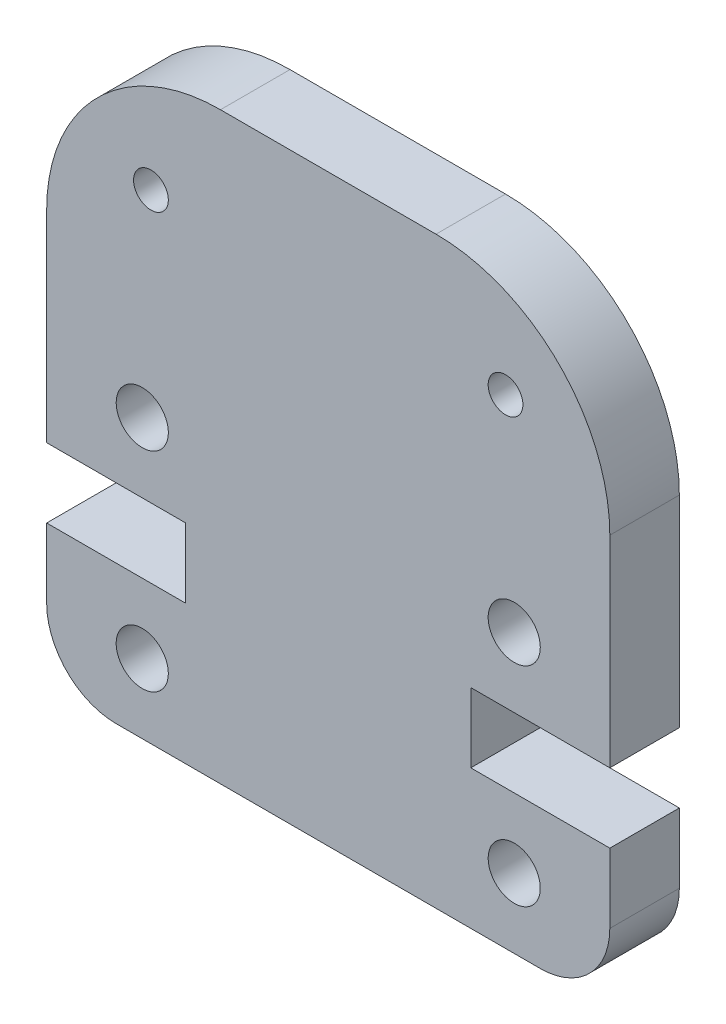
ISO-10303-21;
HEADER;
FILE_DESCRIPTION(('STEP AP214'),'2;1');
FILE_NAME('part.step','',(''),(''),'','','');
FILE_SCHEMA(('AUTOMOTIVE_DESIGN { 1 0 10303 214 1 1 1 1 }'));
ENDSEC;
DATA;
#1=APPLICATION_CONTEXT('core data for automotive mechanical design processes');
#2=APPLICATION_PROTOCOL_DEFINITION('international standard','automotive_design',2000,#1);
#3=PRODUCT_CONTEXT('',#1,'mechanical');
#4=PRODUCT('Part','Part','',(#3));
#5=PRODUCT_RELATED_PRODUCT_CATEGORY('part','',(#4));
#6=PRODUCT_DEFINITION_FORMATION('','',#4);
#7=PRODUCT_DEFINITION_CONTEXT('part definition',#1,'design');
#8=PRODUCT_DEFINITION('design','',#6,#7);
#9=PRODUCT_DEFINITION_SHAPE('','',#8);
#10=(LENGTH_UNIT() NAMED_UNIT(*) SI_UNIT(.MILLI.,.METRE.));
#11=(NAMED_UNIT(*) PLANE_ANGLE_UNIT() SI_UNIT($,.RADIAN.));
#12=(NAMED_UNIT(*) SI_UNIT($,.STERADIAN.) SOLID_ANGLE_UNIT());
#13=UNCERTAINTY_MEASURE_WITH_UNIT(LENGTH_MEASURE(1.E-05),#10,'distance_accuracy_value','');
#14=(GEOMETRIC_REPRESENTATION_CONTEXT(3) GLOBAL_UNCERTAINTY_ASSIGNED_CONTEXT((#13)) GLOBAL_UNIT_ASSIGNED_CONTEXT((#10,
#11,#12)) REPRESENTATION_CONTEXT('',''));
#15=CARTESIAN_POINT('',(0.,0.,0.));
#16=DIRECTION('',(0.,0.,1.));
#17=DIRECTION('',(1.,0.,0.));
#18=AXIS2_PLACEMENT_3D('',#15,#16,#17);
#19=CARTESIAN_POINT('',(5.,11.795,2.));
#20=DIRECTION('',(0.,0.,1.));
#21=DIRECTION('',(1.,0.,0.));
#22=AXIS2_PLACEMENT_3D('',#19,#20,#21);
#23=PLANE('',#22);
#24=CARTESIAN_POINT('',(2.75000000000089,2.,2.));
#25=DIRECTION('',(0.,0.,1.));
#26=DIRECTION('',(1.,0.,0.));
#27=AXIS2_PLACEMENT_3D('',#24,#25,#26);
#28=CIRCLE('',#27,0.750000000000087);
#29=CARTESIAN_POINT('',(3.50000000000098,2.,2.));
#30=VERTEX_POINT('',#29);
#31=EDGE_CURVE('E352',#30,#30,#28,.T.);
#32=ORIENTED_EDGE('',*,*,#31,.F.);
#33=EDGE_LOOP('',(#32));
#34=FACE_BOUND('',#33,.T.);
#35=CARTESIAN_POINT('',(3.00000000000434,13.7949999999999,2.));
#36=DIRECTION('',(0.,0.,1.));
#37=DIRECTION('',(1.,0.,0.));
#38=AXIS2_PLACEMENT_3D('',#35,#36,#37);
#39=CIRCLE('',#38,0.499999999999945);
#40=CARTESIAN_POINT('',(3.50000000000429,13.7949999999999,2.));
#41=VERTEX_POINT('',#40);
#42=EDGE_CURVE('E364',#41,#41,#39,.T.);
#43=ORIENTED_EDGE('',*,*,#42,.F.);
#44=EDGE_LOOP('',(#43));
#45=FACE_BOUND('',#44,.T.);
#46=CARTESIAN_POINT('',(13.4499999999991,2.,2.));
#47=DIRECTION('',(0.,0.,1.));
#48=DIRECTION('',(-1.,0.,0.));
#49=AXIS2_PLACEMENT_3D('',#46,#47,#48);
#50=CIRCLE('',#49,0.750000000000886);
#51=CARTESIAN_POINT('',(12.6999999999982,2.,2.));
#52=VERTEX_POINT('',#51);
#53=EDGE_CURVE('E182',#52,#52,#50,.T.);
#54=ORIENTED_EDGE('',*,*,#53,.F.);
#55=EDGE_LOOP('',(#54));
#56=FACE_BOUND('',#55,.T.);
#57=CARTESIAN_POINT('',(5.,11.795,2.));
#58=DIRECTION('',(0.,0.,1.));
#59=DIRECTION('',(1.,0.,0.));
#60=AXIS2_PLACEMENT_3D('',#57,#58,#59);
#61=CIRCLE('',#60,5.);
#62=CARTESIAN_POINT('',(5.,16.795,2.));
#63=VERTEX_POINT('',#62);
#64=CARTESIAN_POINT('',(0.,11.795,2.));
#65=VERTEX_POINT('',#64);
#66=EDGE_CURVE('E209',#63,#65,#61,.T.);
#67=ORIENTED_EDGE('',*,*,#66,.T.);
#68=DIRECTION('',(0.,-1.,0.));
#69=VECTOR('',#68,1.);
#70=CARTESIAN_POINT('',(0.,6.00000000000001,2.));
#71=LINE('',#70,#69);
#72=CARTESIAN_POINT('',(0.,6.00000000000001,2.));
#73=VERTEX_POINT('',#72);
#74=EDGE_CURVE('E117',#65,#73,#71,.T.);
#75=ORIENTED_EDGE('',*,*,#74,.T.);
#76=DIRECTION('',(1.,0.,0.));
#77=VECTOR('',#76,1.);
#78=CARTESIAN_POINT('',(0.,6.00000000000001,2.));
#79=LINE('',#78,#77);
#80=CARTESIAN_POINT('',(4.,6.00000000000001,2.));
#81=VERTEX_POINT('',#80);
#82=EDGE_CURVE('E248',#73,#81,#79,.T.);
#83=ORIENTED_EDGE('',*,*,#82,.T.);
#84=DIRECTION('',(0.,-1.,0.));
#85=VECTOR('',#84,1.);
#86=CARTESIAN_POINT('',(4.,6.00000000000001,2.));
#87=LINE('',#86,#85);
#88=CARTESIAN_POINT('',(4.,4.,2.));
#89=VERTEX_POINT('',#88);
#90=EDGE_CURVE('E267',#81,#89,#87,.T.);
#91=ORIENTED_EDGE('',*,*,#90,.T.);
#92=DIRECTION('',(-1.,0.,0.));
#93=VECTOR('',#92,1.);
#94=CARTESIAN_POINT('',(4.,4.,2.));
#95=LINE('',#94,#93);
#96=CARTESIAN_POINT('',(0.,4.,2.));
#97=VERTEX_POINT('',#96);
#98=EDGE_CURVE('E264',#89,#97,#95,.T.);
#99=ORIENTED_EDGE('',*,*,#98,.T.);
#100=DIRECTION('',(0.,-1.,0.));
#101=VECTOR('',#100,1.);
#102=CARTESIAN_POINT('',(0.,2.,2.));
#103=LINE('',#102,#101);
#104=CARTESIAN_POINT('',(0.,2.,2.));
#105=VERTEX_POINT('',#104);
#106=EDGE_CURVE('E266',#97,#105,#103,.T.);
#107=ORIENTED_EDGE('',*,*,#106,.T.);
#108=CARTESIAN_POINT('',(2.,2.,2.));
#109=DIRECTION('',(0.,0.,1.));
#110=DIRECTION('',(1.,0.,0.));
#111=AXIS2_PLACEMENT_3D('',#108,#109,#110);
#112=CIRCLE('',#111,2.);
#113=CARTESIAN_POINT('',(2.,0.,2.));
#114=VERTEX_POINT('',#113);
#115=EDGE_CURVE('E269',#105,#114,#112,.T.);
#116=ORIENTED_EDGE('',*,*,#115,.T.);
#117=DIRECTION('',(1.,0.,0.));
#118=VECTOR('',#117,1.);
#119=CARTESIAN_POINT('',(2.,0.,2.));
#120=LINE('',#119,#118);
#121=CARTESIAN_POINT('',(14.2,0.,2.));
#122=VERTEX_POINT('',#121);
#123=EDGE_CURVE('E275',#114,#122,#120,.T.);
#124=ORIENTED_EDGE('',*,*,#123,.T.);
#125=CARTESIAN_POINT('',(14.2,2.,2.));
#126=DIRECTION('',(0.,0.,1.));
#127=DIRECTION('',(-1.,0.,0.));
#128=AXIS2_PLACEMENT_3D('',#125,#126,#127);
#129=CIRCLE('',#128,2.);
#130=CARTESIAN_POINT('',(16.2,2.,2.));
#131=VERTEX_POINT('',#130);
#132=EDGE_CURVE('E277',#122,#131,#129,.T.);
#133=ORIENTED_EDGE('',*,*,#132,.T.);
#134=DIRECTION('',(0.,1.,0.));
#135=VECTOR('',#134,1.);
#136=CARTESIAN_POINT('',(16.2,2.,2.));
#137=LINE('',#136,#135);
#138=CARTESIAN_POINT('',(16.2,4.,2.));
#139=VERTEX_POINT('',#138);
#140=EDGE_CURVE('E279',#131,#139,#137,.T.);
#141=ORIENTED_EDGE('',*,*,#140,.T.);
#142=DIRECTION('',(-1.,0.,0.));
#143=VECTOR('',#142,1.);
#144=CARTESIAN_POINT('',(12.2,4.,2.));
#145=LINE('',#144,#143);
#146=CARTESIAN_POINT('',(12.2,4.,2.));
#147=VERTEX_POINT('',#146);
#148=EDGE_CURVE('E281',#139,#147,#145,.T.);
#149=ORIENTED_EDGE('',*,*,#148,.T.);
#150=DIRECTION('',(0.,1.,0.));
#151=VECTOR('',#150,1.);
#152=CARTESIAN_POINT('',(12.2,6.,2.));
#153=LINE('',#152,#151);
#154=CARTESIAN_POINT('',(12.2,6.,2.));
#155=VERTEX_POINT('',#154);
#156=EDGE_CURVE('E283',#147,#155,#153,.T.);
#157=ORIENTED_EDGE('',*,*,#156,.T.);
#158=DIRECTION('',(1.,0.,0.));
#159=VECTOR('',#158,1.);
#160=CARTESIAN_POINT('',(16.2,6.00000000000001,2.));
#161=LINE('',#160,#159);
#162=CARTESIAN_POINT('',(16.2,6.00000000000001,2.));
#163=VERTEX_POINT('',#162);
#164=EDGE_CURVE('E160',#155,#163,#161,.T.);
#165=ORIENTED_EDGE('',*,*,#164,.T.);
#166=DIRECTION('',(0.,1.,0.));
#167=VECTOR('',#166,1.);
#168=CARTESIAN_POINT('',(16.2,6.00000000000001,2.));
#169=LINE('',#168,#167);
#170=CARTESIAN_POINT('',(16.2,11.795,2.));
#171=VERTEX_POINT('',#170);
#172=EDGE_CURVE('E154',#163,#171,#169,.T.);
#173=ORIENTED_EDGE('',*,*,#172,.T.);
#174=CARTESIAN_POINT('',(11.2,11.795,2.));
#175=DIRECTION('',(0.,0.,1.));
#176=DIRECTION('',(-1.,0.,0.));
#177=AXIS2_PLACEMENT_3D('',#174,#175,#176);
#178=CIRCLE('',#177,5.);
#179=CARTESIAN_POINT('',(11.2,16.795,2.));
#180=VERTEX_POINT('',#179);
#181=EDGE_CURVE('E158',#171,#180,#178,.T.);
#182=ORIENTED_EDGE('',*,*,#181,.T.);
#183=DIRECTION('',(-1.,0.,0.));
#184=VECTOR('',#183,1.);
#185=CARTESIAN_POINT('',(5.,16.795,2.));
#186=LINE('',#185,#184);
#187=EDGE_CURVE('E50',#180,#63,#186,.T.);
#188=ORIENTED_EDGE('',*,*,#187,.T.);
#189=EDGE_LOOP('',(#67,#75,#83,#91,#99,#107,#116,#124,#133,#141,#149,#157,#165,#173,#182,#188));
#190=FACE_BOUND('',#189,.T.);
#191=CARTESIAN_POINT('',(13.4499999999991,7.99999999999954,2.));
#192=DIRECTION('',(0.,0.,1.));
#193=DIRECTION('',(1.,0.,0.));
#194=AXIS2_PLACEMENT_3D('',#191,#192,#193);
#195=CIRCLE('',#194,0.750000000000887);
#196=CARTESIAN_POINT('',(14.2,7.99999999999954,2.));
#197=VERTEX_POINT('',#196);
#198=EDGE_CURVE('E370',#197,#197,#195,.T.);
#199=ORIENTED_EDGE('',*,*,#198,.F.);
#200=EDGE_LOOP('',(#199));
#201=FACE_BOUND('',#200,.T.);
#202=CARTESIAN_POINT('',(13.1999999999957,13.7949999999999,2.));
#203=DIRECTION('',(0.,0.,1.));
#204=DIRECTION('',(-1.,0.,0.));
#205=AXIS2_PLACEMENT_3D('',#202,#203,#204);
#206=CIRCLE('',#205,0.499999999999945);
#207=CARTESIAN_POINT('',(12.6999999999957,13.7949999999999,2.));
#208=VERTEX_POINT('',#207);
#209=EDGE_CURVE('E358',#208,#208,#206,.T.);
#210=ORIENTED_EDGE('',*,*,#209,.F.);
#211=EDGE_LOOP('',(#210));
#212=FACE_BOUND('',#211,.T.);
#213=CARTESIAN_POINT('',(2.75000000000089,7.99999999999954,2.));
#214=DIRECTION('',(0.,0.,1.));
#215=DIRECTION('',(-1.,0.,0.));
#216=AXIS2_PLACEMENT_3D('',#213,#214,#215);
#217=CIRCLE('',#216,0.750000000000087);
#218=CARTESIAN_POINT('',(2.0000000000008,7.99999999999954,2.));
#219=VERTEX_POINT('',#218);
#220=EDGE_CURVE('E343',#219,#219,#217,.T.);
#221=ORIENTED_EDGE('',*,*,#220,.F.);
#222=EDGE_LOOP('',(#221));
#223=FACE_BOUND('',#222,.T.);
#224=ADVANCED_FACE('F33',(#34,#45,#56,#190,#201,#212,#223),#23,.T.);
#225=CARTESIAN_POINT('',(5.,11.795,0.));
#226=DIRECTION('',(0.,0.,1.));
#227=DIRECTION('',(1.,0.,0.));
#228=AXIS2_PLACEMENT_3D('',#225,#226,#227);
#229=PLANE('',#228);
#230=CARTESIAN_POINT('',(2.75000000000089,2.,0.));
#231=DIRECTION('',(0.,0.,1.));
#232=DIRECTION('',(1.,0.,0.));
#233=AXIS2_PLACEMENT_3D('',#230,#231,#232);
#234=CIRCLE('',#233,0.750000000000087);
#235=CARTESIAN_POINT('',(3.50000000000098,2.,0.));
#236=VERTEX_POINT('',#235);
#237=EDGE_CURVE('E349',#236,#236,#234,.T.);
#238=ORIENTED_EDGE('',*,*,#237,.T.);
#239=EDGE_LOOP('',(#238));
#240=FACE_BOUND('',#239,.T.);
#241=CARTESIAN_POINT('',(3.00000000000434,13.7949999999999,0.));
#242=DIRECTION('',(0.,0.,1.));
#243=DIRECTION('',(1.,0.,0.));
#244=AXIS2_PLACEMENT_3D('',#241,#242,#243);
#245=CIRCLE('',#244,0.499999999999945);
#246=CARTESIAN_POINT('',(3.50000000000429,13.7949999999999,0.));
#247=VERTEX_POINT('',#246);
#248=EDGE_CURVE('E361',#247,#247,#245,.T.);
#249=ORIENTED_EDGE('',*,*,#248,.T.);
#250=EDGE_LOOP('',(#249));
#251=FACE_BOUND('',#250,.T.);
#252=CARTESIAN_POINT('',(13.4499999999991,2.,0.));
#253=DIRECTION('',(0.,0.,1.));
#254=DIRECTION('',(-1.,0.,0.));
#255=AXIS2_PLACEMENT_3D('',#252,#253,#254);
#256=CIRCLE('',#255,0.750000000000886);
#257=CARTESIAN_POINT('',(12.6999999999982,2.,0.));
#258=VERTEX_POINT('',#257);
#259=EDGE_CURVE('E373',#258,#258,#256,.T.);
#260=ORIENTED_EDGE('',*,*,#259,.T.);
#261=EDGE_LOOP('',(#260));
#262=FACE_BOUND('',#261,.T.);
#263=CARTESIAN_POINT('',(5.,11.795,0.));
#264=DIRECTION('',(0.,0.,1.));
#265=DIRECTION('',(1.,0.,0.));
#266=AXIS2_PLACEMENT_3D('',#263,#264,#265);
#267=CIRCLE('',#266,5.);
#268=CARTESIAN_POINT('',(5.,16.795,0.));
#269=VERTEX_POINT('',#268);
#270=CARTESIAN_POINT('',(0.,11.795,0.));
#271=VERTEX_POINT('',#270);
#272=EDGE_CURVE('E178',#269,#271,#267,.T.);
#273=ORIENTED_EDGE('',*,*,#272,.F.);
#274=DIRECTION('',(-1.,0.,0.));
#275=VECTOR('',#274,1.);
#276=CARTESIAN_POINT('',(5.,16.795,0.));
#277=LINE('',#276,#275);
#278=CARTESIAN_POINT('',(11.2,16.795,0.));
#279=VERTEX_POINT('',#278);
#280=EDGE_CURVE('E109',#279,#269,#277,.T.);
#281=ORIENTED_EDGE('',*,*,#280,.F.);
#282=CARTESIAN_POINT('',(11.2,11.795,0.));
#283=DIRECTION('',(0.,0.,1.));
#284=DIRECTION('',(-1.,0.,0.));
#285=AXIS2_PLACEMENT_3D('',#282,#283,#284);
#286=CIRCLE('',#285,5.);
#287=CARTESIAN_POINT('',(16.2,11.795,0.));
#288=VERTEX_POINT('',#287);
#289=EDGE_CURVE('E103',#288,#279,#286,.T.);
#290=ORIENTED_EDGE('',*,*,#289,.F.);
#291=DIRECTION('',(0.,1.,0.));
#292=VECTOR('',#291,1.);
#293=CARTESIAN_POINT('',(16.2,6.00000000000001,0.));
#294=LINE('',#293,#292);
#295=CARTESIAN_POINT('',(16.2,6.00000000000001,0.));
#296=VERTEX_POINT('',#295);
#297=EDGE_CURVE('E168',#296,#288,#294,.T.);
#298=ORIENTED_EDGE('',*,*,#297,.F.);
#299=DIRECTION('',(1.,0.,0.));
#300=VECTOR('',#299,1.);
#301=CARTESIAN_POINT('',(16.2,6.00000000000001,0.));
#302=LINE('',#301,#300);
#303=CARTESIAN_POINT('',(12.2,6.,0.));
#304=VERTEX_POINT('',#303);
#305=EDGE_CURVE('E204',#304,#296,#302,.T.);
#306=ORIENTED_EDGE('',*,*,#305,.F.);
#307=DIRECTION('',(0.,1.,0.));
#308=VECTOR('',#307,1.);
#309=CARTESIAN_POINT('',(12.2,6.,0.));
#310=LINE('',#309,#308);
#311=CARTESIAN_POINT('',(12.2,4.,0.));
#312=VERTEX_POINT('',#311);
#313=EDGE_CURVE('E202',#312,#304,#310,.T.);
#314=ORIENTED_EDGE('',*,*,#313,.F.);
#315=DIRECTION('',(-1.,0.,0.));
#316=VECTOR('',#315,1.);
#317=CARTESIAN_POINT('',(12.2,4.,0.));
#318=LINE('',#317,#316);
#319=CARTESIAN_POINT('',(16.2,4.,0.));
#320=VERTEX_POINT('',#319);
#321=EDGE_CURVE('E200',#320,#312,#318,.T.);
#322=ORIENTED_EDGE('',*,*,#321,.F.);
#323=DIRECTION('',(0.,1.,0.));
#324=VECTOR('',#323,1.);
#325=CARTESIAN_POINT('',(16.2,2.,0.));
#326=LINE('',#325,#324);
#327=CARTESIAN_POINT('',(16.2,2.,0.));
#328=VERTEX_POINT('',#327);
#329=EDGE_CURVE('E198',#328,#320,#326,.T.);
#330=ORIENTED_EDGE('',*,*,#329,.F.);
#331=CARTESIAN_POINT('',(14.2,2.,0.));
#332=DIRECTION('',(0.,0.,1.));
#333=DIRECTION('',(-1.,0.,0.));
#334=AXIS2_PLACEMENT_3D('',#331,#332,#333);
#335=CIRCLE('',#334,2.);
#336=CARTESIAN_POINT('',(14.2,0.,0.));
#337=VERTEX_POINT('',#336);
#338=EDGE_CURVE('E196',#337,#328,#335,.T.);
#339=ORIENTED_EDGE('',*,*,#338,.F.);
#340=DIRECTION('',(1.,0.,0.));
#341=VECTOR('',#340,1.);
#342=CARTESIAN_POINT('',(2.,0.,0.));
#343=LINE('',#342,#341);
#344=CARTESIAN_POINT('',(2.,0.,0.));
#345=VERTEX_POINT('',#344);
#346=EDGE_CURVE('E194',#345,#337,#343,.T.);
#347=ORIENTED_EDGE('',*,*,#346,.F.);
#348=CARTESIAN_POINT('',(2.,2.,0.));
#349=DIRECTION('',(0.,0.,1.));
#350=DIRECTION('',(1.,0.,0.));
#351=AXIS2_PLACEMENT_3D('',#348,#349,#350);
#352=CIRCLE('',#351,2.);
#353=CARTESIAN_POINT('',(0.,2.,0.));
#354=VERTEX_POINT('',#353);
#355=EDGE_CURVE('E192',#354,#345,#352,.T.);
#356=ORIENTED_EDGE('',*,*,#355,.F.);
#357=DIRECTION('',(0.,-1.,0.));
#358=VECTOR('',#357,1.);
#359=CARTESIAN_POINT('',(0.,2.,0.));
#360=LINE('',#359,#358);
#361=CARTESIAN_POINT('',(0.,4.,0.));
#362=VERTEX_POINT('',#361);
#363=EDGE_CURVE('E190',#362,#354,#360,.T.);
#364=ORIENTED_EDGE('',*,*,#363,.F.);
#365=DIRECTION('',(-1.,0.,0.));
#366=VECTOR('',#365,1.);
#367=CARTESIAN_POINT('',(4.,4.,0.));
#368=LINE('',#367,#366);
#369=CARTESIAN_POINT('',(4.,4.,0.));
#370=VERTEX_POINT('',#369);
#371=EDGE_CURVE('E188',#370,#362,#368,.T.);
#372=ORIENTED_EDGE('',*,*,#371,.F.);
#373=DIRECTION('',(0.,-1.,0.));
#374=VECTOR('',#373,1.);
#375=CARTESIAN_POINT('',(4.,6.00000000000001,0.));
#376=LINE('',#375,#374);
#377=CARTESIAN_POINT('',(4.,6.00000000000001,0.));
#378=VERTEX_POINT('',#377);
#379=EDGE_CURVE('E186',#378,#370,#376,.T.);
#380=ORIENTED_EDGE('',*,*,#379,.F.);
#381=DIRECTION('',(1.,0.,0.));
#382=VECTOR('',#381,1.);
#383=CARTESIAN_POINT('',(0.,6.00000000000001,0.));
#384=LINE('',#383,#382);
#385=CARTESIAN_POINT('',(0.,6.00000000000001,0.));
#386=VERTEX_POINT('',#385);
#387=EDGE_CURVE('E184',#386,#378,#384,.T.);
#388=ORIENTED_EDGE('',*,*,#387,.F.);
#389=DIRECTION('',(0.,-1.,0.));
#390=VECTOR('',#389,1.);
#391=CARTESIAN_POINT('',(0.,6.00000000000001,0.));
#392=LINE('',#391,#390);
#393=EDGE_CURVE('E181',#271,#386,#392,.T.);
#394=ORIENTED_EDGE('',*,*,#393,.F.);
#395=EDGE_LOOP('',(#273,#281,#290,#298,#306,#314,#322,#330,#339,#347,#356,#364,#372,#380,#388,#394));
#396=FACE_BOUND('',#395,.T.);
#397=CARTESIAN_POINT('',(13.4499999999991,7.99999999999954,0.));
#398=DIRECTION('',(0.,0.,1.));
#399=DIRECTION('',(1.,0.,0.));
#400=AXIS2_PLACEMENT_3D('',#397,#398,#399);
#401=CIRCLE('',#400,0.750000000000887);
#402=CARTESIAN_POINT('',(14.2,7.99999999999954,0.));
#403=VERTEX_POINT('',#402);
#404=EDGE_CURVE('E367',#403,#403,#401,.T.);
#405=ORIENTED_EDGE('',*,*,#404,.T.);
#406=EDGE_LOOP('',(#405));
#407=FACE_BOUND('',#406,.T.);
#408=CARTESIAN_POINT('',(13.1999999999957,13.7949999999999,0.));
#409=DIRECTION('',(0.,0.,1.));
#410=DIRECTION('',(-1.,0.,0.));
#411=AXIS2_PLACEMENT_3D('',#408,#409,#410);
#412=CIRCLE('',#411,0.499999999999945);
#413=CARTESIAN_POINT('',(12.6999999999957,13.7949999999999,0.));
#414=VERTEX_POINT('',#413);
#415=EDGE_CURVE('E355',#414,#414,#412,.T.);
#416=ORIENTED_EDGE('',*,*,#415,.T.);
#417=EDGE_LOOP('',(#416));
#418=FACE_BOUND('',#417,.T.);
#419=CARTESIAN_POINT('',(2.75000000000089,7.99999999999954,0.));
#420=DIRECTION('',(0.,0.,1.));
#421=DIRECTION('',(-1.,0.,0.));
#422=AXIS2_PLACEMENT_3D('',#419,#420,#421);
#423=CIRCLE('',#422,0.750000000000087);
#424=CARTESIAN_POINT('',(2.0000000000008,7.99999999999954,0.));
#425=VERTEX_POINT('',#424);
#426=EDGE_CURVE('E346',#425,#425,#423,.T.);
#427=ORIENTED_EDGE('',*,*,#426,.T.);
#428=EDGE_LOOP('',(#427));
#429=FACE_BOUND('',#428,.T.);
#430=ADVANCED_FACE('F252',(#240,#251,#262,#396,#407,#418,#429),#229,.F.);
#431=CARTESIAN_POINT('',(5.,11.795,2.));
#432=DIRECTION('',(0.,0.,-1.));
#433=DIRECTION('',(-1.,0.,0.));
#434=AXIS2_PLACEMENT_3D('',#431,#432,#433);
#435=CYLINDRICAL_SURFACE('',#434,5.);
#436=ORIENTED_EDGE('',*,*,#272,.T.);
#437=DIRECTION('',(0.,0.,-1.));
#438=VECTOR('',#437,1.);
#439=CARTESIAN_POINT('',(0.,11.795,2.));
#440=LINE('',#439,#438);
#441=EDGE_CURVE('E11',#65,#271,#440,.T.);
#442=ORIENTED_EDGE('',*,*,#441,.F.);
#443=ORIENTED_EDGE('',*,*,#66,.F.);
#444=DIRECTION('',(0.,0.,-1.));
#445=VECTOR('',#444,1.);
#446=CARTESIAN_POINT('',(5.,16.795,2.));
#447=LINE('',#446,#445);
#448=EDGE_CURVE('E174',#63,#269,#447,.T.);
#449=ORIENTED_EDGE('',*,*,#448,.T.);
#450=EDGE_LOOP('',(#436,#442,#443,#449));
#451=FACE_BOUND('',#450,.T.);
#452=ADVANCED_FACE('F35',(#451),#435,.T.);
#453=CARTESIAN_POINT('',(0.,6.00000000000001,2.));
#454=DIRECTION('',(1.,0.,0.));
#455=DIRECTION('',(0.,0.,-1.));
#456=AXIS2_PLACEMENT_3D('',#453,#454,#455);
#457=PLANE('',#456);
#458=ORIENTED_EDGE('',*,*,#393,.T.);
#459=DIRECTION('',(0.,0.,-1.));
#460=VECTOR('',#459,1.);
#461=CARTESIAN_POINT('',(0.,6.00000000000001,2.));
#462=LINE('',#461,#460);
#463=EDGE_CURVE('E42',#73,#386,#462,.T.);
#464=ORIENTED_EDGE('',*,*,#463,.F.);
#465=ORIENTED_EDGE('',*,*,#74,.F.);
#466=ORIENTED_EDGE('',*,*,#441,.T.);
#467=EDGE_LOOP('',(#458,#464,#465,#466));
#468=FACE_BOUND('',#467,.T.);
#469=ADVANCED_FACE('F540',(#468),#457,.F.);
#470=CARTESIAN_POINT('',(0.,6.00000000000001,2.));
#471=DIRECTION('',(0.,1.,0.));
#472=DIRECTION('',(0.,0.,1.));
#473=AXIS2_PLACEMENT_3D('',#470,#471,#472);
#474=PLANE('',#473);
#475=ORIENTED_EDGE('',*,*,#387,.T.);
#476=DIRECTION('',(0.,0.,-1.));
#477=VECTOR('',#476,1.);
#478=CARTESIAN_POINT('',(4.,6.00000000000001,2.));
#479=LINE('',#478,#477);
#480=EDGE_CURVE('E240',#81,#378,#479,.T.);
#481=ORIENTED_EDGE('',*,*,#480,.F.);
#482=ORIENTED_EDGE('',*,*,#82,.F.);
#483=ORIENTED_EDGE('',*,*,#463,.T.);
#484=EDGE_LOOP('',(#475,#481,#482,#483));
#485=FACE_BOUND('',#484,.T.);
#486=ADVANCED_FACE('F246',(#485),#474,.F.);
#487=CARTESIAN_POINT('',(4.,6.00000000000001,2.));
#488=DIRECTION('',(1.,0.,0.));
#489=DIRECTION('',(0.,0.,-1.));
#490=AXIS2_PLACEMENT_3D('',#487,#488,#489);
#491=PLANE('',#490);
#492=ORIENTED_EDGE('',*,*,#379,.T.);
#493=DIRECTION('',(0.,0.,-1.));
#494=VECTOR('',#493,1.);
#495=CARTESIAN_POINT('',(4.,4.,2.));
#496=LINE('',#495,#494);
#497=EDGE_CURVE('E237',#89,#370,#496,.T.);
#498=ORIENTED_EDGE('',*,*,#497,.F.);
#499=ORIENTED_EDGE('',*,*,#90,.F.);
#500=ORIENTED_EDGE('',*,*,#480,.T.);
#501=EDGE_LOOP('',(#492,#498,#499,#500));
#502=FACE_BOUND('',#501,.T.);
#503=ADVANCED_FACE('F258',(#502),#491,.F.);
#504=CARTESIAN_POINT('',(4.,4.,2.));
#505=DIRECTION('',(0.,-1.,0.));
#506=DIRECTION('',(0.,0.,-1.));
#507=AXIS2_PLACEMENT_3D('',#504,#505,#506);
#508=PLANE('',#507);
#509=ORIENTED_EDGE('',*,*,#371,.T.);
#510=DIRECTION('',(0.,0.,-1.));
#511=VECTOR('',#510,1.);
#512=CARTESIAN_POINT('',(0.,4.,2.));
#513=LINE('',#512,#511);
#514=EDGE_CURVE('E234',#97,#362,#513,.T.);
#515=ORIENTED_EDGE('',*,*,#514,.F.);
#516=ORIENTED_EDGE('',*,*,#98,.F.);
#517=ORIENTED_EDGE('',*,*,#497,.T.);
#518=EDGE_LOOP('',(#509,#515,#516,#517));
#519=FACE_BOUND('',#518,.T.);
#520=ADVANCED_FACE('F262',(#519),#508,.F.);
#521=CARTESIAN_POINT('',(0.,2.,2.));
#522=DIRECTION('',(1.,0.,0.));
#523=DIRECTION('',(0.,0.,-1.));
#524=AXIS2_PLACEMENT_3D('',#521,#522,#523);
#525=PLANE('',#524);
#526=ORIENTED_EDGE('',*,*,#363,.T.);
#527=DIRECTION('',(0.,0.,-1.));
#528=VECTOR('',#527,1.);
#529=CARTESIAN_POINT('',(0.,2.,2.));
#530=LINE('',#529,#528);
#531=EDGE_CURVE('E231',#105,#354,#530,.T.);
#532=ORIENTED_EDGE('',*,*,#531,.F.);
#533=ORIENTED_EDGE('',*,*,#106,.F.);
#534=ORIENTED_EDGE('',*,*,#514,.T.);
#535=EDGE_LOOP('',(#526,#532,#533,#534));
#536=FACE_BOUND('',#535,.T.);
#537=ADVANCED_FACE('F505',(#536),#525,.F.);
#538=CARTESIAN_POINT('',(2.,2.,2.));
#539=DIRECTION('',(0.,0.,-1.));
#540=DIRECTION('',(-1.,0.,0.));
#541=AXIS2_PLACEMENT_3D('',#538,#539,#540);
#542=CYLINDRICAL_SURFACE('',#541,2.);
#543=ORIENTED_EDGE('',*,*,#355,.T.);
#544=DIRECTION('',(0.,0.,-1.));
#545=VECTOR('',#544,1.);
#546=CARTESIAN_POINT('',(2.,0.,2.));
#547=LINE('',#546,#545);
#548=EDGE_CURVE('E228',#114,#345,#547,.T.);
#549=ORIENTED_EDGE('',*,*,#548,.F.);
#550=ORIENTED_EDGE('',*,*,#115,.F.);
#551=ORIENTED_EDGE('',*,*,#531,.T.);
#552=EDGE_LOOP('',(#543,#549,#550,#551));
#553=FACE_BOUND('',#552,.T.);
#554=ADVANCED_FACE('F495',(#553),#542,.T.);
#555=CARTESIAN_POINT('',(2.,0.,2.));
#556=DIRECTION('',(0.,1.,0.));
#557=DIRECTION('',(-1.,0.,0.));
#558=AXIS2_PLACEMENT_3D('',#555,#556,#557);
#559=PLANE('',#558);
#560=ORIENTED_EDGE('',*,*,#346,.T.);
#561=DIRECTION('',(0.,0.,-1.));
#562=VECTOR('',#561,1.);
#563=CARTESIAN_POINT('',(14.2,0.,2.));
#564=LINE('',#563,#562);
#565=EDGE_CURVE('E225',#122,#337,#564,.T.);
#566=ORIENTED_EDGE('',*,*,#565,.F.);
#567=ORIENTED_EDGE('',*,*,#123,.F.);
#568=ORIENTED_EDGE('',*,*,#548,.T.);
#569=EDGE_LOOP('',(#560,#566,#567,#568));
#570=FACE_BOUND('',#569,.T.);
#571=ADVANCED_FACE('F485',(#570),#559,.F.);
#572=CARTESIAN_POINT('',(14.2,2.,2.));
#573=DIRECTION('',(0.,0.,-1.));
#574=DIRECTION('',(-1.,0.,0.));
#575=AXIS2_PLACEMENT_3D('',#572,#573,#574);
#576=CYLINDRICAL_SURFACE('',#575,2.);
#577=ORIENTED_EDGE('',*,*,#338,.T.);
#578=DIRECTION('',(0.,0.,-1.));
#579=VECTOR('',#578,1.);
#580=CARTESIAN_POINT('',(16.2,2.,2.));
#581=LINE('',#580,#579);
#582=EDGE_CURVE('E222',#131,#328,#581,.T.);
#583=ORIENTED_EDGE('',*,*,#582,.F.);
#584=ORIENTED_EDGE('',*,*,#132,.F.);
#585=ORIENTED_EDGE('',*,*,#565,.T.);
#586=EDGE_LOOP('',(#577,#583,#584,#585));
#587=FACE_BOUND('',#586,.T.);
#588=ADVANCED_FACE('F475',(#587),#576,.T.);
#589=CARTESIAN_POINT('',(16.2,2.,2.));
#590=DIRECTION('',(-1.,0.,0.));
#591=DIRECTION('',(0.,0.,1.));
#592=AXIS2_PLACEMENT_3D('',#589,#590,#591);
#593=PLANE('',#592);
#594=ORIENTED_EDGE('',*,*,#329,.T.);
#595=DIRECTION('',(0.,0.,-1.));
#596=VECTOR('',#595,1.);
#597=CARTESIAN_POINT('',(16.2,4.,2.));
#598=LINE('',#597,#596);
#599=EDGE_CURVE('E219',#139,#320,#598,.T.);
#600=ORIENTED_EDGE('',*,*,#599,.F.);
#601=ORIENTED_EDGE('',*,*,#140,.F.);
#602=ORIENTED_EDGE('',*,*,#582,.T.);
#603=EDGE_LOOP('',(#594,#600,#601,#602));
#604=FACE_BOUND('',#603,.T.);
#605=ADVANCED_FACE('F465',(#604),#593,.F.);
#606=CARTESIAN_POINT('',(12.2,4.,2.));
#607=DIRECTION('',(0.,-1.,0.));
#608=DIRECTION('',(1.,0.,0.));
#609=AXIS2_PLACEMENT_3D('',#606,#607,#608);
#610=PLANE('',#609);
#611=ORIENTED_EDGE('',*,*,#321,.T.);
#612=DIRECTION('',(0.,0.,-1.));
#613=VECTOR('',#612,1.);
#614=CARTESIAN_POINT('',(12.2,4.,2.));
#615=LINE('',#614,#613);
#616=EDGE_CURVE('E216',#147,#312,#615,.T.);
#617=ORIENTED_EDGE('',*,*,#616,.F.);
#618=ORIENTED_EDGE('',*,*,#148,.F.);
#619=ORIENTED_EDGE('',*,*,#599,.T.);
#620=EDGE_LOOP('',(#611,#617,#618,#619));
#621=FACE_BOUND('',#620,.T.);
#622=ADVANCED_FACE('F456',(#621),#610,.F.);
#623=CARTESIAN_POINT('',(12.2,6.,2.));
#624=DIRECTION('',(-1.,0.,0.));
#625=DIRECTION('',(0.,0.,1.));
#626=AXIS2_PLACEMENT_3D('',#623,#624,#625);
#627=PLANE('',#626);
#628=ORIENTED_EDGE('',*,*,#313,.T.);
#629=DIRECTION('',(0.,0.,-1.));
#630=VECTOR('',#629,1.);
#631=CARTESIAN_POINT('',(12.2,6.,2.));
#632=LINE('',#631,#630);
#633=EDGE_CURVE('E213',#155,#304,#632,.T.);
#634=ORIENTED_EDGE('',*,*,#633,.F.);
#635=ORIENTED_EDGE('',*,*,#156,.F.);
#636=ORIENTED_EDGE('',*,*,#616,.T.);
#637=EDGE_LOOP('',(#628,#634,#635,#636));
#638=FACE_BOUND('',#637,.T.);
#639=ADVANCED_FACE('F289',(#638),#627,.F.);
#640=CARTESIAN_POINT('',(16.2,6.00000000000001,2.));
#641=DIRECTION('',(0.,1.,0.));
#642=DIRECTION('',(-1.,0.,0.));
#643=AXIS2_PLACEMENT_3D('',#640,#641,#642);
#644=PLANE('',#643);
#645=ORIENTED_EDGE('',*,*,#305,.T.);
#646=DIRECTION('',(0.,0.,-1.));
#647=VECTOR('',#646,1.);
#648=CARTESIAN_POINT('',(16.2,6.00000000000001,2.));
#649=LINE('',#648,#647);
#650=EDGE_CURVE('E169',#163,#296,#649,.T.);
#651=ORIENTED_EDGE('',*,*,#650,.F.);
#652=ORIENTED_EDGE('',*,*,#164,.F.);
#653=ORIENTED_EDGE('',*,*,#633,.T.);
#654=EDGE_LOOP('',(#645,#651,#652,#653));
#655=FACE_BOUND('',#654,.T.);
#656=ADVANCED_FACE('F293',(#655),#644,.F.);
#657=CARTESIAN_POINT('',(16.2,6.00000000000001,2.));
#658=DIRECTION('',(-1.,0.,0.));
#659=DIRECTION('',(0.,-1.,0.));
#660=AXIS2_PLACEMENT_3D('',#657,#658,#659);
#661=PLANE('',#660);
#662=ORIENTED_EDGE('',*,*,#297,.T.);
#663=DIRECTION('',(0.,0.,-1.));
#664=VECTOR('',#663,1.);
#665=CARTESIAN_POINT('',(16.2,11.795,2.));
#666=LINE('',#665,#664);
#667=EDGE_CURVE('E165',#171,#288,#666,.T.);
#668=ORIENTED_EDGE('',*,*,#667,.F.);
#669=ORIENTED_EDGE('',*,*,#172,.F.);
#670=ORIENTED_EDGE('',*,*,#650,.T.);
#671=EDGE_LOOP('',(#662,#668,#669,#670));
#672=FACE_BOUND('',#671,.T.);
#673=ADVANCED_FACE('F166',(#672),#661,.F.);
#674=CARTESIAN_POINT('',(11.2,11.795,2.));
#675=DIRECTION('',(0.,0.,-1.));
#676=DIRECTION('',(-1.,0.,0.));
#677=AXIS2_PLACEMENT_3D('',#674,#675,#676);
#678=CYLINDRICAL_SURFACE('',#677,5.);
#679=ORIENTED_EDGE('',*,*,#289,.T.);
#680=DIRECTION('',(0.,0.,-1.));
#681=VECTOR('',#680,1.);
#682=CARTESIAN_POINT('',(11.2,16.795,2.));
#683=LINE('',#682,#681);
#684=EDGE_CURVE('E170',#180,#279,#683,.T.);
#685=ORIENTED_EDGE('',*,*,#684,.F.);
#686=ORIENTED_EDGE('',*,*,#181,.F.);
#687=ORIENTED_EDGE('',*,*,#667,.T.);
#688=EDGE_LOOP('',(#679,#685,#686,#687));
#689=FACE_BOUND('',#688,.T.);
#690=ADVANCED_FACE('F172',(#689),#678,.T.);
#691=CARTESIAN_POINT('',(5.,16.795,2.));
#692=DIRECTION('',(0.,-1.,0.));
#693=DIRECTION('',(0.,0.,-1.));
#694=AXIS2_PLACEMENT_3D('',#691,#692,#693);
#695=PLANE('',#694);
#696=ORIENTED_EDGE('',*,*,#280,.T.);
#697=ORIENTED_EDGE('',*,*,#448,.F.);
#698=ORIENTED_EDGE('',*,*,#187,.F.);
#699=ORIENTED_EDGE('',*,*,#684,.T.);
#700=EDGE_LOOP('',(#696,#697,#698,#699));
#701=FACE_BOUND('',#700,.T.);
#702=ADVANCED_FACE('F297',(#701),#695,.F.);
#703=CARTESIAN_POINT('',(13.4499999999991,2.,2.));
#704=DIRECTION('',(0.,0.,-1.));
#705=DIRECTION('',(-1.,0.,0.));
#706=AXIS2_PLACEMENT_3D('',#703,#704,#705);
#707=CYLINDRICAL_SURFACE('',#706,0.750000000000886);
#708=ORIENTED_EDGE('',*,*,#53,.T.);
#709=EDGE_LOOP('',(#708));
#710=FACE_BOUND('',#709,.T.);
#711=ORIENTED_EDGE('',*,*,#259,.F.);
#712=EDGE_LOOP('',(#711));
#713=FACE_BOUND('',#712,.T.);
#714=ADVANCED_FACE('F299',(#710,#713),#707,.F.);
#715=CARTESIAN_POINT('',(13.4499999999991,7.99999999999954,2.));
#716=DIRECTION('',(0.,0.,-1.));
#717=DIRECTION('',(-1.,0.,0.));
#718=AXIS2_PLACEMENT_3D('',#715,#716,#717);
#719=CYLINDRICAL_SURFACE('',#718,0.750000000000887);
#720=ORIENTED_EDGE('',*,*,#198,.T.);
#721=EDGE_LOOP('',(#720));
#722=FACE_BOUND('',#721,.T.);
#723=ORIENTED_EDGE('',*,*,#404,.F.);
#724=EDGE_LOOP('',(#723));
#725=FACE_BOUND('',#724,.T.);
#726=ADVANCED_FACE('F305',(#722,#725),#719,.F.);
#727=CARTESIAN_POINT('',(3.00000000000434,13.7949999999999,2.));
#728=DIRECTION('',(0.,0.,-1.));
#729=DIRECTION('',(-1.,0.,0.));
#730=AXIS2_PLACEMENT_3D('',#727,#728,#729);
#731=CYLINDRICAL_SURFACE('',#730,0.499999999999945);
#732=ORIENTED_EDGE('',*,*,#42,.T.);
#733=EDGE_LOOP('',(#732));
#734=FACE_BOUND('',#733,.T.);
#735=ORIENTED_EDGE('',*,*,#248,.F.);
#736=EDGE_LOOP('',(#735));
#737=FACE_BOUND('',#736,.T.);
#738=ADVANCED_FACE('F322',(#734,#737),#731,.F.);
#739=CARTESIAN_POINT('',(13.1999999999957,13.7949999999999,2.));
#740=DIRECTION('',(0.,0.,-1.));
#741=DIRECTION('',(-1.,0.,0.));
#742=AXIS2_PLACEMENT_3D('',#739,#740,#741);
#743=CYLINDRICAL_SURFACE('',#742,0.499999999999945);
#744=ORIENTED_EDGE('',*,*,#209,.T.);
#745=EDGE_LOOP('',(#744));
#746=FACE_BOUND('',#745,.T.);
#747=ORIENTED_EDGE('',*,*,#415,.F.);
#748=EDGE_LOOP('',(#747));
#749=FACE_BOUND('',#748,.T.);
#750=ADVANCED_FACE('F326',(#746,#749),#743,.F.);
#751=CARTESIAN_POINT('',(2.75000000000089,2.,2.));
#752=DIRECTION('',(0.,0.,-1.));
#753=DIRECTION('',(-1.,0.,0.));
#754=AXIS2_PLACEMENT_3D('',#751,#752,#753);
#755=CYLINDRICAL_SURFACE('',#754,0.750000000000087);
#756=ORIENTED_EDGE('',*,*,#31,.T.);
#757=EDGE_LOOP('',(#756));
#758=FACE_BOUND('',#757,.T.);
#759=ORIENTED_EDGE('',*,*,#237,.F.);
#760=EDGE_LOOP('',(#759));
#761=FACE_BOUND('',#760,.T.);
#762=ADVANCED_FACE('F330',(#758,#761),#755,.F.);
#763=CARTESIAN_POINT('',(2.75000000000089,7.99999999999954,2.));
#764=DIRECTION('',(0.,0.,-1.));
#765=DIRECTION('',(-1.,0.,0.));
#766=AXIS2_PLACEMENT_3D('',#763,#764,#765);
#767=CYLINDRICAL_SURFACE('',#766,0.750000000000087);
#768=ORIENTED_EDGE('',*,*,#220,.T.);
#769=EDGE_LOOP('',(#768));
#770=FACE_BOUND('',#769,.T.);
#771=ORIENTED_EDGE('',*,*,#426,.F.);
#772=EDGE_LOOP('',(#771));
#773=FACE_BOUND('',#772,.T.);
#774=ADVANCED_FACE('F334',(#770,#773),#767,.F.);
#775=CLOSED_SHELL('',(#224,#430,#452,#469,#486,#503,#520,#537,#554,#571,#588,#605,#622,#639,
#656,#673,#690,#702,#714,#726,#738,#750,#762,#774));
#776=MANIFOLD_SOLID_BREP('B2',#775);
#777=ADVANCED_BREP_SHAPE_REPRESENTATION('',(#18,#776),#14);
#778=SHAPE_DEFINITION_REPRESENTATION(#9,#777);
ENDSEC;
END-ISO-10303-21;
